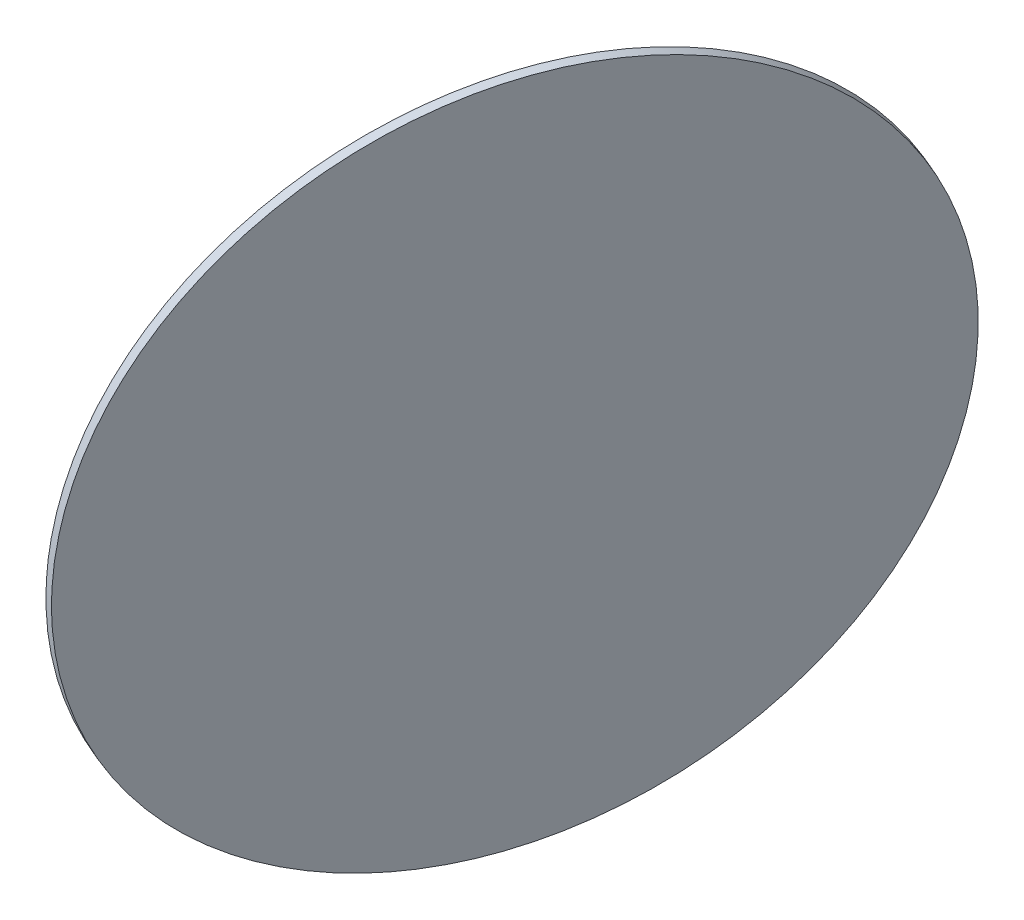
ISO-10303-21;
HEADER;
FILE_DESCRIPTION(('STEP AP214'),'2;1');
FILE_NAME('part.step','',(''),(''),'','','');
FILE_SCHEMA(('AUTOMOTIVE_DESIGN { 1 0 10303 214 1 1 1 1 }'));
ENDSEC;
DATA;
#1=APPLICATION_CONTEXT('core data for automotive mechanical design processes');
#2=APPLICATION_PROTOCOL_DEFINITION('international standard','automotive_design',2000,#1);
#3=PRODUCT_CONTEXT('',#1,'mechanical');
#4=PRODUCT('Part','Part','',(#3));
#5=PRODUCT_RELATED_PRODUCT_CATEGORY('part','',(#4));
#6=PRODUCT_DEFINITION_FORMATION('','',#4);
#7=PRODUCT_DEFINITION_CONTEXT('part definition',#1,'design');
#8=PRODUCT_DEFINITION('design','',#6,#7);
#9=PRODUCT_DEFINITION_SHAPE('','',#8);
#10=(LENGTH_UNIT() NAMED_UNIT(*) SI_UNIT(.MILLI.,.METRE.));
#11=(NAMED_UNIT(*) PLANE_ANGLE_UNIT() SI_UNIT($,.RADIAN.));
#12=(NAMED_UNIT(*) SI_UNIT($,.STERADIAN.) SOLID_ANGLE_UNIT());
#13=UNCERTAINTY_MEASURE_WITH_UNIT(LENGTH_MEASURE(1.E-05),#10,'distance_accuracy_value','');
#14=(GEOMETRIC_REPRESENTATION_CONTEXT(3) GLOBAL_UNCERTAINTY_ASSIGNED_CONTEXT((#13)) GLOBAL_UNIT_ASSIGNED_CONTEXT((#10,
#11,#12)) REPRESENTATION_CONTEXT('',''));
#15=CARTESIAN_POINT('',(0.,0.,0.));
#16=DIRECTION('',(0.,0.,1.));
#17=DIRECTION('',(1.,0.,0.));
#18=AXIS2_PLACEMENT_3D('',#15,#16,#17);
#19=CARTESIAN_POINT('',(-481.922089196081,94.4598188319987,74.0852881046836));
#20=CARTESIAN_POINT('',(-482.673535302618,86.08527129108,73.8122133748399));
#21=CARTESIAN_POINT('',(-483.894115274308,69.3361762092426,72.4891980559884));
#22=CARTESIAN_POINT('',(-484.860416229143,44.4544879989238,68.1931895413502));
#23=CARTESIAN_POINT('',(-484.952842174851,20.0543784602219,61.6270684007838));
#24=CARTESIAN_POINT('',(-484.170502999048,-3.62916601354872,52.8540699702805));
#25=CARTESIAN_POINT('',(-482.520933055668,-26.3680599423632,41.9586830205342));
#26=CARTESIAN_POINT('',(-480.020018605011,-47.9433153473432,29.0458360838957));
#27=CARTESIAN_POINT('',(-476.691844820377,-68.1471507247046,14.2398869352446));
#28=CARTESIAN_POINT('',(-472.568463834677,-86.7849920952234,-2.31657504136209));
#29=CARTESIAN_POINT('',(-467.689586060872,-103.677346858021,-20.4641020664071));
#30=CARTESIAN_POINT('',(-462.102197758989,-118.661532402431,-40.0279235341917));
#31=CARTESIAN_POINT('',(-455.860108532754,-131.593242830473,-60.8196291493088));
#32=CARTESIAN_POINT('',(-449.023433113688,-142.347938701531,-82.6389834207819));
#33=CARTESIAN_POINT('',(-441.658012423382,-150.822046415253,-105.275854039305));
#34=CARTESIAN_POINT('',(-433.834779489435,-156.933955681937,-128.512235566249));
#35=CARTESIAN_POINT('',(-425.629076321613,-160.624805474236,-152.124348945211));
#36=CARTESIAN_POINT('',(-417.119928327116,-161.859050891026,-175.884796616658));
#37=CARTESIAN_POINT('',(-408.389283252705,-160.624805474236,-199.564752480731));
#38=CARTESIAN_POINT('',(-399.521221983102,-156.933955681937,-222.93616561768));
#39=CARTESIAN_POINT('',(-390.60114879611,-150.822046415253,-245.773956542881));
#40=CARTESIAN_POINT('',(-381.714968872726,-142.347938701531,-267.858184845318));
#41=CARTESIAN_POINT('',(-372.948260983294,-131.593242830473,-288.976167333972));
#42=CARTESIAN_POINT('',(-364.385453317158,-118.661532402431,-308.924526293213));
#43=CARTESIAN_POINT('',(-356.10901039305,-103.677346858021,-327.511148121381));
#44=CARTESIAN_POINT('',(-348.198638880693,-86.7849920952233,-344.557033489791));
#45=CARTESIAN_POINT('',(-340.730519982,-68.1471507247046,-359.898021204115));
#46=CARTESIAN_POINT('',(-333.776575764455,-47.9433153473433,-373.386369166429));
#47=CARTESIAN_POINT('',(-327.403776512285,-26.3680599423631,-384.892177212372));
#48=CARTESIAN_POINT('',(-321.673495766015,-3.62916601354882,-394.30463812075));
#49=CARTESIAN_POINT('',(-316.640919261721,20.0543784602218,-401.533104747638));
#50=CARTESIAN_POINT('',(-312.354513462227,44.4544879989238,-406.50796300794));
#51=CARTESIAN_POINT('',(-308.855558798569,69.3361762092424,-409.181302297073));
#52=CARTESIAN_POINT('',(-306.177752116881,94.4598188319987,-409.527376896289));
#53=CARTESIAN_POINT('',(-304.346882159345,119.583461454755,-407.542853918012));
#54=CARTESIAN_POINT('',(-303.38058120451,144.465149665074,-403.246845403373));
#55=CARTESIAN_POINT('',(-303.288155258802,168.865259203775,-396.680724262807));
#56=CARTESIAN_POINT('',(-304.070494434605,192.548803677546,-387.907725832303));
#57=CARTESIAN_POINT('',(-305.720064377986,215.28769760636,-377.012338882557));
#58=CARTESIAN_POINT('',(-308.220978828642,236.862953011341,-364.099491945919));
#59=CARTESIAN_POINT('',(-311.549152613276,257.066788388702,-349.293542797268));
#60=CARTESIAN_POINT('',(-315.672533598976,275.704629759221,-332.737080820661));
#61=CARTESIAN_POINT('',(-320.551411372782,292.596984522018,-314.589553795616));
#62=CARTESIAN_POINT('',(-326.138799674664,307.581170066429,-295.025732327831));
#63=CARTESIAN_POINT('',(-332.380888900899,320.51288049447,-274.234026712714));
#64=CARTESIAN_POINT('',(-339.217564319966,331.267576365528,-252.414672441241));
#65=CARTESIAN_POINT('',(-346.582985010271,339.74168407925,-229.777801822718));
#66=CARTESIAN_POINT('',(-354.406217944218,345.853593345934,-206.541420295774));
#67=CARTESIAN_POINT('',(-362.611921112041,349.544443138233,-182.929306916812));
#68=CARTESIAN_POINT('',(-371.121069106537,350.778688555023,-159.168859245365));
#69=CARTESIAN_POINT('',(-379.851714180948,349.544443138233,-135.488903381292));
#70=CARTESIAN_POINT('',(-388.719775450551,345.853593345935,-112.117490244343));
#71=CARTESIAN_POINT('',(-397.639848637543,339.74168407925,-89.2796993191417));
#72=CARTESIAN_POINT('',(-406.526028560927,331.267576365528,-67.1954710167044));
#73=CARTESIAN_POINT('',(-415.292736450359,320.51288049447,-46.0774885280508));
#74=CARTESIAN_POINT('',(-423.855544116495,307.581170066429,-26.12912956881));
#75=CARTESIAN_POINT('',(-432.131987040604,292.596984522018,-7.54250774064129));
#76=CARTESIAN_POINT('',(-440.04235855296,275.704629759221,9.50337762776827));
#77=CARTESIAN_POINT('',(-447.510477451653,257.066788388702,24.8443653420926));
#78=CARTESIAN_POINT('',(-454.464421669198,236.862953011341,38.3327133044055));
#79=CARTESIAN_POINT('',(-460.837220921368,215.28769760636,49.8385213503491));
#80=CARTESIAN_POINT('',(-466.567501667639,192.548803677546,59.2509822587265));
#81=CARTESIAN_POINT('',(-471.600078171932,168.865259203776,66.4794488856154));
#82=CARTESIAN_POINT('',(-475.886483971426,144.465149665074,71.4543071459168));
#83=CARTESIAN_POINT('',(-479.385438635085,119.583461454755,74.1276464350506));
#84=CARTESIAN_POINT('',(-481.170643089543,102.834366372917,74.3583628345273));
#85=CARTESIAN_POINT('',(-481.922089196081,94.4598188319987,74.0852881046836));
#86=B_SPLINE_CURVE_WITH_KNOTS('',3,(#19,#20,#21,#22,#23,#24,#25,#26,#27,#28,#29,#30,#31,#32,#33,
#34,#35,#36,#37,#38,#39,#40,#41,#42,#43,#44,#45,#46,#47,#48,#49,#50,#51,#52,#53,#54,#55,#56,#57,
#58,#59,#60,#61,#62,#63,#64,#65,#66,#67,#68,#69,#70,#71,#72,#73,#74,#75,#76,#77,#78,#79,#80,#81,
#82,#83,#84,#85),.UNSPECIFIED.,.T.,.F.,(4,1,1,1,1,1,1,1,1,1,1,1,1,1,1,1,1,1,1,1,1,1,1,1,1,1,1,1,
1,1,1,1,1,1,1,1,1,1,1,1,1,1,1,1,1,1,1,1,1,1,1,1,1,1,1,1,1,1,1,1,1,1,1,1,4),(0.,0.015625,0.03125,
0.046875,0.0625,0.078125,0.09375,0.109375,0.125,0.140625,0.15625,0.171875,0.1875,0.203125,
0.21875,0.234375,0.25,0.265625,0.28125,0.296875,0.3125,0.328125,0.34375,0.359375,0.375,0.390625,
0.40625,0.421875,0.4375,0.453125,0.46875,0.484375,0.5,0.515625,0.53125,0.546875,0.5625,0.578125,
0.59375,0.609375,0.625,0.640625,0.65625,0.671875,0.6875,0.703125,0.71875,0.734375,0.75,0.765625,
0.78125,0.796875,0.8125,0.828125,0.84375,0.859375,0.875,0.890625,0.90625,0.921875,0.9375,
0.953125,0.96875,0.984375,1.),.UNSPECIFIED.);
#87=DIRECTION('',(-0.935610835790205,0.0950387497409739,-0.339999999999453));
#88=VECTOR('',#87,1.);
#89=SURFACE_OF_LINEAR_EXTRUSION('',#86,#88);
#90=CARTESIAN_POINT('',(-481.92208919608,94.4598188319987,74.0852881046836));
#91=CARTESIAN_POINT('',(-481.546366142812,98.6470926024581,74.2218254696055));
#92=CARTESIAN_POINT('',(-481.13535405937,102.834366372917,74.2612546021318));
#93=CARTESIAN_POINT('',(-480.243826363065,111.198832479985,74.146035272709));
#94=CARTESIAN_POINT('',(-479.763310750202,115.376024816592,73.9913868107599));
#95=CARTESIAN_POINT('',(-478.733850525977,123.710246622105,73.4881511627017));
#96=CARTESIAN_POINT('',(-478.184905914616,127.86727609101,73.1395639765927));
#97=CARTESIAN_POINT('',(-477.019991728652,136.151187816983,72.2495236184961));
#98=CARTESIAN_POINT('',(-476.40402215405,140.278070074052,71.7080704465085));
#99=CARTESIAN_POINT('',(-475.106462076857,148.491703032223,70.433370854936));
#100=CARTESIAN_POINT('',(-474.424871574268,152.578453733324,69.7001244353511));
#101=CARTESIAN_POINT('',(-472.997789659063,160.702032479836,68.0438346237748));
#102=CARTESIAN_POINT('',(-472.252298246448,164.738860525248,67.1207912317834));
#103=CARTESIAN_POINT('',(-470.69913452915,172.75280286066,65.086903750585));
#104=CARTESIAN_POINT('',(-469.891462224467,176.72991715066,63.976059661378));
#105=CARTESIAN_POINT('',(-468.215956158987,184.614928413583,61.5694713726275));
#106=CARTESIAN_POINT('',(-467.348122398189,188.522825386505,60.273727173084));
#107=CARTESIAN_POINT('',(-465.554312856429,196.259898453602,57.5002392505396));
#108=CARTESIAN_POINT('',(-464.628337075466,200.089074547778,56.0224955275388));
#109=CARTESIAN_POINT('',(-462.720542899046,207.659581358262,52.8887855224097));
#110=CARTESIAN_POINT('',(-461.738724503588,211.400912074572,51.2328192402816));
#111=CARTESIAN_POINT('',(-459.721544503848,218.786603630204,47.7464410812281));
#112=CARTESIAN_POINT('',(-458.686182899566,222.430964469527,45.9160292043028));
#113=CARTESIAN_POINT('',(-456.564473713031,229.61405870853,42.0853768232048));
#114=CARTESIAN_POINT('',(-455.478126130779,233.152792108209,40.0851363190321));
#115=CARTESIAN_POINT('',(-453.25700221916,240.115973905266,35.9194436509894));
#116=CARTESIAN_POINT('',(-452.122225889793,243.540422302644,33.7539914871193));
#117=CARTESIAN_POINT('',(-449.807034912454,250.266926845963,29.2632880065298));
#118=CARTESIAN_POINT('',(-448.626620264482,253.568982991905,26.9380366898105));
#119=CARTESIAN_POINT('',(-446.222943078442,260.042595783218,22.133147410371));
#120=CARTESIAN_POINT('',(-444.999680540374,263.21415242859,19.6535094476508));
#121=CARTESIAN_POINT('',(-442.513304326955,269.419287360393,14.5460027969563));
#122=CARTESIAN_POINT('',(-441.250190651604,272.452865646824,11.918134108982));
#123=CARTESIAN_POINT('',(-438.687108916429,278.374565002377,6.52032192852638));
#124=CARTESIAN_POINT('',(-437.387140856605,281.262686071498,3.75037843604502));
#125=CARTESIAN_POINT('',(-434.753524569233,286.886692550319,-1.92474330366122));
#126=CARTESIAN_POINT('',(-433.419876341684,289.62257796002,-4.82992155088611));
#127=CARTESIAN_POINT('',(-430.722073935606,294.935334677888,-10.7686727503158));
#128=CARTESIAN_POINT('',(-429.357919757078,297.512205986056,-13.8022457025206));
#129=CARTESIAN_POINT('',(-426.60242656028,302.50092175511,-19.9903280065482));
#130=CARTESIAN_POINT('',(-425.211087542011,304.912766215996,-23.144837358371));
#131=CARTESIAN_POINT('',(-422.40454577697,309.565415544738,-29.5673341562726));
#132=CARTESIAN_POINT('',(-420.989343030199,311.806220412594,-32.8353216023513));
#133=CARTESIAN_POINT('',(-418.138509829767,316.111601411915,-39.4767698553625));
#134=CARTESIAN_POINT('',(-416.702879376107,318.176177543381,-42.8502306622948));
#135=CARTESIAN_POINT('',(-413.814626783513,322.123911926564,-49.6946209036106));
#136=CARTESIAN_POINT('',(-412.362004644578,324.007070178281,-53.165550337994));
#137=CARTESIAN_POINT('',(-409.443286522656,327.587653235286,-60.1964037627274));
#138=CARTESIAN_POINT('',(-407.97719053967,329.285078040574,-63.7563277530773));
#139=CARTESIAN_POINT('',(-405.035042570867,332.489878638037,-70.9566962182591));
#140=CARTESIAN_POINT('',(-403.558990585051,333.997254430213,-74.597140693091));
#141=CARTESIAN_POINT('',(-400.600496392688,336.818556572716,-81.949688327611));
#142=CARTESIAN_POINT('',(-399.11805418614,338.132482923043,-85.661791487299));
#143=CARTESIAN_POINT('',(-396.150345334411,340.563485753111,-93.1487946919054));
#144=CARTESIAN_POINT('',(-394.665078689229,341.680562232852,-96.9236947368237));
#145=CARTESIAN_POINT('',(-391.695300342773,343.71541277894,-104.527127528098));
#146=CARTESIAN_POINT('',(-390.210788641499,344.633186845288,-108.355660274455));
#147=CARTESIAN_POINT('',(-387.2460995654,346.266980021786,-116.057194284813));
#148=CARTESIAN_POINT('',(-385.765922190575,346.982999131935,-119.930195548815));
#149=CARTESIAN_POINT('',(-382.813460278949,348.211801358487,-127.711288282605));
#150=CARTESIAN_POINT('',(-381.341175742148,348.724584474891,-131.619379752394));
#151=CARTESIAN_POINT('',(-378.408058018146,349.545433676406,-139.461274585897));
#152=CARTESIAN_POINT('',(-376.947224830944,349.853499761517,-143.395077949613));
#153=CARTESIAN_POINT('',(-374.040513176337,350.264419631361,-151.278894449314));
#154=CARTESIAN_POINT('',(-372.594634708932,350.367273416093,-155.2289075853));
#155=CARTESIAN_POINT('',(-369.721335864114,350.367273416093,-163.135641507887));
#156=CARTESIAN_POINT('',(-368.293915486702,350.264419631361,-167.092362294488));
#157=CARTESIAN_POINT('',(-365.460947311318,349.853499761517,-175.002977097476));
#158=CARTESIAN_POINT('',(-364.055399513346,349.545433676406,-178.956871113864));
#159=CARTESIAN_POINT('',(-361.269590986293,348.724584474891,-186.852297955599));
#160=CARTESIAN_POINT('',(-359.889330257211,348.211801358488,-190.793830780946));
#161=CARTESIAN_POINT('',(-357.157388593237,346.982999131935,-198.655060342286));
#162=CARTESIAN_POINT('',(-355.805707658345,346.266980021786,-202.574757078279));
#163=CARTESIAN_POINT('',(-353.13421830805,344.633186845288,-210.382839562596));
#164=CARTESIAN_POINT('',(-351.814409892647,343.71541277894,-214.271225310921));
#165=CARTESIAN_POINT('',(-349.209804831738,341.680562232852,-222.007361692552));
#166=CARTESIAN_POINT('',(-347.925008186232,340.563485753111,-225.855112325859));
#167=CARTESIAN_POINT('',(-345.393565915523,338.132482923043,-233.500654350103));
#168=CARTESIAN_POINT('',(-344.146920290321,336.818556572716,-237.298445741041));
#169=CARTESIAN_POINT('',(-341.694735603036,333.997254430213,-244.834985720606));
#170=CARTESIAN_POINT('',(-340.489196540953,332.489878638037,-248.573734309233));
#171=CARTESIAN_POINT('',(-338.122180522724,329.285078040574,-255.983105124232));
#172=CARTESIAN_POINT('',(-336.960703566578,327.587653235287,-259.653727350605));
#173=CARTESIAN_POINT('',(-334.684555131956,324.007070178282,-266.918089928208));
#174=CARTESIAN_POINT('',(-333.569883653479,322.123911926564,-270.511830279439));
#175=CARTESIAN_POINT('',(-331.390089545929,318.176177543381,-277.61367359387));
#176=CARTESIAN_POINT('',(-330.324966916855,316.111601411915,-281.121776557071));
#177=CARTESIAN_POINT('',(-328.24677528859,311.806220412594,-288.044001949986));
#178=CARTESIAN_POINT('',(-327.233706289399,309.565415544738,-291.4581243797));
#179=CARTESIAN_POINT('',(-325.262126701379,304.912766215996,-298.184045560184));
#180=CARTESIAN_POINT('',(-324.303616112551,302.50092175511,-301.495844310953));
#181=CARTESIAN_POINT('',(-322.443395412079,297.512205986056,-308.009267704573));
#182=CARTESIAN_POINT('',(-321.541685300435,294.935334677888,-311.210892347423));
#183=CARTESIAN_POINT('',(-319.797307621154,289.62257796002,-317.496117096228));
#184=CARTESIAN_POINT('',(-318.954640053516,286.88669255032,-320.579717202183));
#185=CARTESIAN_POINT('',(-317.330305223082,281.262686071498,-326.621610768627));
#186=CARTESIAN_POINT('',(-316.548637960286,278.374565002377,-329.579904229116));
#187=CARTESIAN_POINT('',(-315.048261500368,272.452865646824,-335.363902396058));
#188=CARTESIAN_POINT('',(-314.329552303247,269.419287360393,-338.189607102511));
#189=CARTESIAN_POINT('',(-312.95674657522,263.21415242859,-343.7017841039));
#190=CARTESIAN_POINT('',(-312.302650044315,260.042595783218,-346.388256398836));
#191=CARTESIAN_POINT('',(-311.060724249259,253.568982991905,-351.615324919713));
#192=CARTESIAN_POINT('',(-310.472894985109,250.266926845963,-354.155921145653));
#193=CARTESIAN_POINT('',(-309.364839229102,243.540422302644,-359.085296304201));
#194=CARTESIAN_POINT('',(-308.844612737246,240.115973905266,-361.474075236809));
#195=CARTESIAN_POINT('',(-307.873098031364,233.152792108209,-366.093874584357));
#196=CARTESIAN_POINT('',(-307.421809817339,229.61405870853,-368.324894999297));
#197=CARTESIAN_POINT('',(-306.589175216008,222.430964469528,-372.623995737557));
#198=CARTESIAN_POINT('',(-306.207828828701,218.786603630205,-374.692076060876));
#199=CARTESIAN_POINT('',(-305.516081429695,211.400912074572,-378.66011504194));
#200=CARTESIAN_POINT('',(-305.205680417995,207.659581358263,-380.560073699685));
#201=CARTESIAN_POINT('',(-304.656485697714,200.089074547778,-384.187497327419));
#202=CARTESIAN_POINT('',(-304.417691989133,196.259898453602,-385.914962297409));
#203=CARTESIAN_POINT('',(-304.012373802603,188.522825386505,-389.19302652745));
#204=CARTESIAN_POINT('',(-303.845849324653,184.614928413583,-390.743625787503));
#205=CARTESIAN_POINT('',(-303.585383530799,176.72991715066,-393.664438232225));
#206=CARTESIAN_POINT('',(-303.491442214895,172.75280286066,-395.034651416895));
#207=CARTESIAN_POINT('',(-303.376456676546,164.738860525248,-397.591171345406));
#208=CARTESIAN_POINT('',(-303.355412454101,160.702032479836,-398.777478089248));
#209=CARTESIAN_POINT('',(-303.386184014654,152.578453733324,-400.963550330437));
#210=CARTESIAN_POINT('',(-303.437999797652,148.491703032223,-401.963315827785));
#211=CARTESIAN_POINT('',(-303.614454281076,140.278070074053,-403.773670770319));
#212=CARTESIAN_POINT('',(-303.739092981502,136.151187816984,-404.584260215505));
#213=CARTESIAN_POINT('',(-304.060805549512,127.86727609101,-406.01453918245));
#214=CARTESIAN_POINT('',(-304.257879417098,123.710246622105,-406.634228704208));
#215=CARTESIAN_POINT('',(-304.724074569159,115.376024816593,-407.680983953027));
#216=CARTESIAN_POINT('',(-304.993195853636,111.198832479985,-408.108049680089));
#217=CARTESIAN_POINT('',(-305.602751161208,102.834366372918,-408.768761004467));
#218=CARTESIAN_POINT('',(-305.943185184304,98.6470926024583,-409.002406601785));
#219=CARTESIAN_POINT('',(-306.694631290841,90.2725450615396,-409.275481331628));
#220=CARTESIAN_POINT('',(-307.105643374283,86.0852712910803,-409.314910464155));
#221=CARTESIAN_POINT('',(-307.997171070588,77.7208051840131,-409.199691134732));
#222=CARTESIAN_POINT('',(-308.477686683451,73.5436128474053,-409.045042672783));
#223=CARTESIAN_POINT('',(-309.507146907676,65.2093910418928,-408.541807024725));
#224=CARTESIAN_POINT('',(-310.056091519037,61.0523615729881,-408.193219838616));
#225=CARTESIAN_POINT('',(-311.221005705,52.7684498470144,-407.303179480519));
#226=CARTESIAN_POINT('',(-311.836975279603,48.6415675899453,-406.761726308531));
#227=CARTESIAN_POINT('',(-313.134535356795,40.4279346317752,-405.487026716959));
#228=CARTESIAN_POINT('',(-313.816125859385,36.3411839306741,-404.753780297374));
#229=CARTESIAN_POINT('',(-315.24320777459,28.2176051841616,-403.097490485798));
#230=CARTESIAN_POINT('',(-315.988699187205,24.1807771387501,-402.174447093806));
#231=CARTESIAN_POINT('',(-317.541862904503,16.1668348033379,-400.140559612608));
#232=CARTESIAN_POINT('',(-318.349535209185,12.1897205133374,-399.029715523401));
#233=CARTESIAN_POINT('',(-320.025041274666,4.30470925041485,-396.62312723465));
#234=CARTESIAN_POINT('',(-320.892875035464,0.396812277492919,-395.327383035107));
#235=CARTESIAN_POINT('',(-322.686684577224,-7.34026078960457,-392.553895112563));
#236=CARTESIAN_POINT('',(-323.612660358187,-11.1694368837801,-391.076151389562));
#237=CARTESIAN_POINT('',(-325.520454534607,-18.739943694265,-387.942441384433));
#238=CARTESIAN_POINT('',(-326.502272930064,-22.4812744105743,-386.286475102305));
#239=CARTESIAN_POINT('',(-328.519452929805,-29.8669659662067,-382.800096943251));
#240=CARTESIAN_POINT('',(-329.554814534087,-33.5113268055299,-380.969685066326));
#241=CARTESIAN_POINT('',(-331.676523720622,-40.6944210445322,-377.139032685228));
#242=CARTESIAN_POINT('',(-332.762871302874,-44.2331544442115,-375.138792181055));
#243=CARTESIAN_POINT('',(-334.983995214493,-51.1963362412684,-370.973099513012));
#244=CARTESIAN_POINT('',(-336.11877154386,-54.6207846386461,-368.807647349142));
#245=CARTESIAN_POINT('',(-338.433962521199,-61.3472891819656,-364.316943868553));
#246=CARTESIAN_POINT('',(-339.614377169171,-64.6493453279074,-361.991692551833));
#247=CARTESIAN_POINT('',(-342.018054355211,-71.1229581192207,-357.186803272394));
#248=CARTESIAN_POINT('',(-343.241316893278,-74.2945147645923,-354.707165309674));
#249=CARTESIAN_POINT('',(-345.727693106698,-80.4996496963953,-349.599658658979));
#250=CARTESIAN_POINT('',(-346.990806782049,-83.5332279828267,-346.971789971005));
#251=CARTESIAN_POINT('',(-349.553888517224,-89.4549273383794,-341.573977790549));
#252=CARTESIAN_POINT('',(-350.853856577047,-92.3430484075007,-338.804034298068));
#253=CARTESIAN_POINT('',(-353.48747286442,-97.9670548863222,-333.128912558361));
#254=CARTESIAN_POINT('',(-354.821121091969,-100.702940296022,-330.223734311137));
#255=CARTESIAN_POINT('',(-357.518923498047,-106.01569701389,-324.284983111707));
#256=CARTESIAN_POINT('',(-358.883077676575,-108.592568322058,-321.251410159502));
#257=CARTESIAN_POINT('',(-361.638570873373,-113.581284091112,-315.063327855475));
#258=CARTESIAN_POINT('',(-363.029909891642,-115.993128551999,-311.908818503652));
#259=CARTESIAN_POINT('',(-365.836451656682,-120.645777880741,-305.48632170575));
#260=CARTESIAN_POINT('',(-367.251654403454,-122.886582748596,-302.218334259672));
#261=CARTESIAN_POINT('',(-370.102487603886,-127.191963747918,-295.57688600666));
#262=CARTESIAN_POINT('',(-371.538118057546,-129.256539879384,-292.203425199728));
#263=CARTESIAN_POINT('',(-374.42637065014,-133.204274262567,-285.359034958412));
#264=CARTESIAN_POINT('',(-375.878992789075,-135.087432514284,-281.888105524029));
#265=CARTESIAN_POINT('',(-378.797710910997,-138.668015571289,-274.857252099295));
#266=CARTESIAN_POINT('',(-380.263806893983,-140.365440376576,-271.297328108945));
#267=CARTESIAN_POINT('',(-383.205954862786,-143.57024097404,-264.096959643764));
#268=CARTESIAN_POINT('',(-384.682006848602,-145.077616766216,-260.456515168932));
#269=CARTESIAN_POINT('',(-387.640501040965,-147.898918908719,-253.103967534412));
#270=CARTESIAN_POINT('',(-389.122943247513,-149.212845259046,-249.391864374724));
#271=CARTESIAN_POINT('',(-392.090652099243,-151.643848089114,-241.904861170117));
#272=CARTESIAN_POINT('',(-393.575918744424,-152.760924568854,-238.129961125199));
#273=CARTESIAN_POINT('',(-396.54569709088,-154.795775114943,-230.526528333924));
#274=CARTESIAN_POINT('',(-398.030208792154,-155.713549181291,-226.697995587568));
#275=CARTESIAN_POINT('',(-400.994897868253,-157.347342357788,-218.99646157721));
#276=CARTESIAN_POINT('',(-402.475075243078,-158.063361467937,-215.123460313208));
#277=CARTESIAN_POINT('',(-405.427537154704,-159.29216369449,-207.342367579417));
#278=CARTESIAN_POINT('',(-406.899821691505,-159.804946810894,-203.434276109629));
#279=CARTESIAN_POINT('',(-409.832939415507,-160.625796012409,-195.592381276125));
#280=CARTESIAN_POINT('',(-411.293772602709,-160.93386209752,-191.65857791241));
#281=CARTESIAN_POINT('',(-414.200484257316,-161.344781967364,-183.774761412708));
#282=CARTESIAN_POINT('',(-415.646362724721,-161.447635752096,-179.824748276722));
#283=CARTESIAN_POINT('',(-418.519661569539,-161.447635752096,-171.918014354135));
#284=CARTESIAN_POINT('',(-419.947081946952,-161.344781967364,-167.961293567535));
#285=CARTESIAN_POINT('',(-422.780050122335,-160.93386209752,-160.050678764547));
#286=CARTESIAN_POINT('',(-424.185597920307,-160.625796012409,-156.096784748159));
#287=CARTESIAN_POINT('',(-426.97140644736,-159.804946810894,-148.201357906424));
#288=CARTESIAN_POINT('',(-428.351667176442,-159.29216369449,-144.259825081077));
#289=CARTESIAN_POINT('',(-431.083608840416,-158.063361467937,-136.398595519737));
#290=CARTESIAN_POINT('',(-432.435289775308,-157.347342357788,-132.478898783744));
#291=CARTESIAN_POINT('',(-435.106779125603,-155.713549181291,-124.670816299426));
#292=CARTESIAN_POINT('',(-436.426587541006,-154.795775114943,-120.782430551101));
#293=CARTESIAN_POINT('',(-439.031192601915,-152.760924568854,-113.04629416947));
#294=CARTESIAN_POINT('',(-440.315989247421,-151.643848089114,-109.198543536164));
#295=CARTESIAN_POINT('',(-442.84743151813,-149.212845259046,-101.553001511919));
#296=CARTESIAN_POINT('',(-444.094077143332,-147.898918908719,-97.7552101209814));
#297=CARTESIAN_POINT('',(-446.546261830617,-145.077616766216,-90.2186701414166));
#298=CARTESIAN_POINT('',(-447.7518008927,-143.57024097404,-86.4799215527899));
#299=CARTESIAN_POINT('',(-450.118816910929,-140.365440376576,-79.0705507377906));
#300=CARTESIAN_POINT('',(-451.280293867075,-138.668015571289,-75.3999285114179));
#301=CARTESIAN_POINT('',(-453.556442301697,-135.087432514284,-68.1355659338147));
#302=CARTESIAN_POINT('',(-454.671113780174,-133.204274262567,-64.541825582584));
#303=CARTESIAN_POINT('',(-456.850907887724,-129.256539879384,-57.4399822681523));
#304=CARTESIAN_POINT('',(-457.916030516798,-127.191963747918,-53.9318793049513));
#305=CARTESIAN_POINT('',(-459.994222145063,-122.886582748596,-47.0096539120363));
#306=CARTESIAN_POINT('',(-461.007291144254,-120.645777880741,-43.5955314823223));
#307=CARTESIAN_POINT('',(-462.978870732273,-115.993128551999,-36.8696103018387));
#308=CARTESIAN_POINT('',(-463.937381321102,-113.581284091112,-33.5578115510691));
#309=CARTESIAN_POINT('',(-465.797602021574,-108.592568322058,-27.0443881574495));
#310=CARTESIAN_POINT('',(-466.699312133218,-106.01569701389,-23.8427635145995));
#311=CARTESIAN_POINT('',(-468.443689812499,-100.702940296022,-17.5575387657946));
#312=CARTESIAN_POINT('',(-469.286357380137,-97.9670548863223,-14.4739386598396));
#313=CARTESIAN_POINT('',(-470.910692210571,-92.3430484075009,-8.43204509339533));
#314=CARTESIAN_POINT('',(-471.692359473367,-89.4549273383796,-5.47375163290609));
#315=CARTESIAN_POINT('',(-473.192735933285,-83.5332279828268,0.310246534035855));
#316=CARTESIAN_POINT('',(-473.911445130406,-80.4996496963954,3.13595124048857));
#317=CARTESIAN_POINT('',(-475.284250858433,-74.2945147645924,8.64812824187757));
#318=CARTESIAN_POINT('',(-475.938347389338,-71.1229581192209,11.3346005368139));
#319=CARTESIAN_POINT('',(-477.180273184394,-64.6493453279075,16.5616690576902));
#320=CARTESIAN_POINT('',(-477.768102448544,-61.3472891819657,19.1022652836301));
#321=CARTESIAN_POINT('',(-478.876158204551,-54.6207846386462,24.0316404421781));
#322=CARTESIAN_POINT('',(-479.396384696407,-51.1963362412686,26.4204193747861));
#323=CARTESIAN_POINT('',(-480.367899402289,-44.2331544442117,31.0402187223344));
#324=CARTESIAN_POINT('',(-480.819187616314,-40.6944210445324,33.2712391372747));
#325=CARTESIAN_POINT('',(-481.651822217646,-33.5113268055301,37.5703398755342));
#326=CARTESIAN_POINT('',(-482.033168604952,-29.866965966207,39.6384201988535));
#327=CARTESIAN_POINT('',(-482.724916003958,-22.4812744105746,43.6064591799176));
#328=CARTESIAN_POINT('',(-483.035317015658,-18.7399436942653,45.5064178376625));
#329=CARTESIAN_POINT('',(-483.584511735939,-11.1694368837804,49.1338414653967));
#330=CARTESIAN_POINT('',(-483.82330544452,-7.34026078960479,50.8613064353859));
#331=CARTESIAN_POINT('',(-484.22862363105,0.396812277492724,54.1393706654275));
#332=CARTESIAN_POINT('',(-484.395148109,4.30470925041465,55.6899699254799));
#333=CARTESIAN_POINT('',(-484.655613902854,12.1897205133372,58.6107823702021));
#334=CARTESIAN_POINT('',(-484.749555218758,16.1668348033377,59.9809955548719));
#335=CARTESIAN_POINT('',(-484.864540757107,24.1807771387498,62.5375154833835));
#336=CARTESIAN_POINT('',(-484.885584979552,28.2176051841613,63.7238222272253));
#337=CARTESIAN_POINT('',(-484.854813418999,36.3411839306738,65.9098944684144));
#338=CARTESIAN_POINT('',(-484.802997636001,40.4279346317748,66.9096599657618));
#339=CARTESIAN_POINT('',(-484.626543152577,48.641567589945,68.7200149082959));
#340=CARTESIAN_POINT('',(-484.501904452151,52.7684498470141,69.5306043534826));
#341=CARTESIAN_POINT('',(-484.18019188414,61.0523615729879,70.9608833204273));
#342=CARTESIAN_POINT('',(-483.983118016555,65.2093910418925,71.5805728421853));
#343=CARTESIAN_POINT('',(-483.516922864493,73.543612847405,72.6273280910045));
#344=CARTESIAN_POINT('',(-483.247801580017,77.7208051840128,73.0543938180658));
#345=CARTESIAN_POINT('',(-482.638246272445,86.08527129108,73.7151051424444));
#346=CARTESIAN_POINT('',(-482.297812249349,90.2725450615393,73.9487507397618));
#347=CARTESIAN_POINT('',(-481.92208919608,94.4598188319987,74.0852881046836));
#348=B_SPLINE_CURVE_WITH_KNOTS('',3,(#90,#91,#92,#93,#94,#95,#96,#97,#98,#99,#100,#101,#102,
#103,#104,#105,#106,#107,#108,#109,#110,#111,#112,#113,#114,#115,#116,#117,#118,#119,#120,#121,
#122,#123,#124,#125,#126,#127,#128,#129,#130,#131,#132,#133,#134,#135,#136,#137,#138,#139,#140,
#141,#142,#143,#144,#145,#146,#147,#148,#149,#150,#151,#152,#153,#154,#155,#156,#157,#158,#159,
#160,#161,#162,#163,#164,#165,#166,#167,#168,#169,#170,#171,#172,#173,#174,#175,#176,#177,#178,
#179,#180,#181,#182,#183,#184,#185,#186,#187,#188,#189,#190,#191,#192,#193,#194,#195,#196,#197,
#198,#199,#200,#201,#202,#203,#204,#205,#206,#207,#208,#209,#210,#211,#212,#213,#214,#215,#216,
#217,#218,#219,#220,#221,#222,#223,#224,#225,#226,#227,#228,#229,#230,#231,#232,#233,#234,#235,
#236,#237,#238,#239,#240,#241,#242,#243,#244,#245,#246,#247,#248,#249,#250,#251,#252,#253,#254,
#255,#256,#257,#258,#259,#260,#261,#262,#263,#264,#265,#266,#267,#268,#269,#270,#271,#272,#273,
#274,#275,#276,#277,#278,#279,#280,#281,#282,#283,#284,#285,#286,#287,#288,#289,#290,#291,#292,
#293,#294,#295,#296,#297,#298,#299,#300,#301,#302,#303,#304,#305,#306,#307,#308,#309,#310,#311,
#312,#313,#314,#315,#316,#317,#318,#319,#320,#321,#322,#323,#324,#325,#326,#327,#328,#329,#330,
#331,#332,#333,#334,#335,#336,#337,#338,#339,#340,#341,#342,#343,#344,#345,#346,#347),
.UNSPECIFIED.,.F.,.F.,(4,2,2,2,2,2,2,2,2,2,2,2,2,2,2,2,2,2,2,2,2,2,2,2,2,2,2,2,2,2,2,2,2,2,2,2,
2,2,2,2,2,2,2,2,2,2,2,2,2,2,2,2,2,2,2,2,2,2,2,2,2,2,2,2,2,2,2,2,2,2,2,2,2,2,2,2,2,2,2,2,2,2,2,2,
2,2,2,2,2,2,2,2,2,2,2,2,2,2,2,2,2,2,2,2,2,2,2,2,2,2,2,2,2,2,2,2,2,2,2,2,2,2,2,2,2,2,2,2,4),(0.,
12.6176781138511,25.2353562277022,37.8530343415533,50.4707124554043,63.0883905692554,
75.7060686831064,88.3237467969574,100.941424910808,113.559103024659,126.17678113851,
138.794459252362,151.412137366213,164.029815480064,176.647493593915,189.265171707766,
201.882849821617,214.500527935468,227.118206049319,239.73588416317,252.353562277021,
264.971240390872,277.588918504723,290.206596618574,302.824274732425,315.441952846276,
328.059630960127,340.677309073979,353.29498718783,365.912665301681,378.530343415532,
391.148021529383,403.765699643234,416.383377757085,429.001055870936,441.618733984787,
454.236412098638,466.854090212489,479.47176832634,492.089446440191,504.707124554042,
517.324802667893,529.942480781744,542.560158895595,555.177837009446,567.795515123297,
580.413193237148,593.030871350999,605.64854946485,618.266227578702,630.883905692553,
643.501583806404,656.119261920255,668.736940034106,681.354618147957,693.972296261808,
706.589974375659,719.20765248951,731.825330603361,744.443008717212,757.060686831063,
769.678364944914,782.296043058765,794.913721172617,807.531399286468,820.149077400319,
832.76675551417,845.384433628021,858.002111741872,870.619789855723,883.237467969574,
895.855146083425,908.472824197276,921.090502311127,933.708180424978,946.325858538829,
958.94353665268,971.561214766531,984.178892880382,996.796570994234,1009.41424910808,
1022.03192722194,1034.64960533579,1047.26728344964,1059.88496156349,1072.50263967734,
1085.12031779119,1097.73799590504,1110.35567401889,1122.97335213274,1135.5910302466,
1148.20870836045,1160.8263864743,1173.44406458815,1186.061742702,1198.67942081585,
1211.2970989297,1223.91477704355,1236.5324551574,1249.15013327125,1261.76781138511,
1274.38548949896,1287.00316761281,1299.62084572666,1312.23852384051,1324.85620195436,
1337.47388006821,1350.09155818206,1362.70923629591,1375.32691440977,1387.94459252362,
1400.56227063747,1413.17994875132,1425.79762686517,1438.41530497902,1451.03298309287,
1463.65066120672,1476.26833932057,1488.88601743443,1501.50369554828,1514.12137366213,
1526.73905177598,1539.35672988983,1551.97440800368,1564.59208611753,1577.20976423138,
1589.82744234523,1602.44512045909,1615.06279857294),.UNSPECIFIED.);
#349=CARTESIAN_POINT('',(-481.92208919608,94.4598188319987,74.0852881046836));
#350=VERTEX_POINT('',#349);
#351=EDGE_CURVE('E9',#350,#350,#348,.F.);
#352=ORIENTED_EDGE('',*,*,#351,.F.);
#353=EDGE_LOOP('',(#352));
#354=FACE_BOUND('',#353,.T.);
#355=CARTESIAN_POINT('',(-488.144590241952,95.0918965047226,71.8240377272166));
#356=CARTESIAN_POINT('',(-488.896036348489,86.7173489638038,71.5509629973729));
#357=CARTESIAN_POINT('',(-490.116616320179,69.9682538819665,70.2279476785214));
#358=CARTESIAN_POINT('',(-491.082917275014,45.0865656716476,65.9319391638832));
#359=CARTESIAN_POINT('',(-491.175343220722,20.6864561329458,59.3658180233169));
#360=CARTESIAN_POINT('',(-490.393004044919,-2.99708834082487,50.5928195928136));
#361=CARTESIAN_POINT('',(-488.743434101539,-25.7359822696393,39.6974326430673));
#362=CARTESIAN_POINT('',(-486.242519650882,-47.3112376746194,26.7845857064287));
#363=CARTESIAN_POINT('',(-482.914345866248,-67.5150730519807,11.9786365577776));
#364=CARTESIAN_POINT('',(-478.790964880548,-86.1529144224996,-4.57782541882902));
#365=CARTESIAN_POINT('',(-473.912087106743,-103.045269185297,-22.7253524438741));
#366=CARTESIAN_POINT('',(-468.32469880486,-118.029454729707,-42.2891739116587));
#367=CARTESIAN_POINT('',(-462.082609578625,-130.961165157749,-63.0808795267758));
#368=CARTESIAN_POINT('',(-455.245934159559,-141.715861028807,-84.9002337982488));
#369=CARTESIAN_POINT('',(-447.880513469253,-150.189968742529,-107.537104416772));
#370=CARTESIAN_POINT('',(-440.057280535306,-156.301878009214,-130.773485943715));
#371=CARTESIAN_POINT('',(-431.851577367484,-159.992727801512,-154.385599322678));
#372=CARTESIAN_POINT('',(-423.342429372987,-161.226973218302,-178.146046994124));
#373=CARTESIAN_POINT('',(-414.611784298576,-159.992727801512,-201.826002858198));
#374=CARTESIAN_POINT('',(-405.743723028973,-156.301878009213,-225.197415995147));
#375=CARTESIAN_POINT('',(-396.823649841981,-150.189968742529,-248.035206920348));
#376=CARTESIAN_POINT('',(-387.937469918597,-141.715861028807,-270.119435222785));
#377=CARTESIAN_POINT('',(-379.170762029165,-130.961165157749,-291.237417711439));
#378=CARTESIAN_POINT('',(-370.607954363029,-118.029454729707,-311.18577667068));
#379=CARTESIAN_POINT('',(-362.331511438921,-103.045269185297,-329.772398498848));
#380=CARTESIAN_POINT('',(-354.421139926564,-86.1529144224995,-346.818283867258));
#381=CARTESIAN_POINT('',(-346.953021027871,-67.5150730519808,-362.159271581582));
#382=CARTESIAN_POINT('',(-339.999076810326,-47.3112376746195,-375.647619543896));
#383=CARTESIAN_POINT('',(-333.626277558156,-25.7359822696392,-387.153427589839));
#384=CARTESIAN_POINT('',(-327.895996811886,-2.99708834082497,-396.565888498217));
#385=CARTESIAN_POINT('',(-322.863420307592,20.6864561329457,-403.794355125105));
#386=CARTESIAN_POINT('',(-318.577014508098,45.0865656716476,-408.769213385407));
#387=CARTESIAN_POINT('',(-315.07805984444,69.9682538819663,-411.44255267454));
#388=CARTESIAN_POINT('',(-312.400253162752,95.0918965047225,-411.788627273755));
#389=CARTESIAN_POINT('',(-310.569383205216,120.215539127479,-409.804104295478));
#390=CARTESIAN_POINT('',(-309.603082250381,145.097227337798,-405.50809578084));
#391=CARTESIAN_POINT('',(-309.510656304673,169.497336876499,-398.941974640274));
#392=CARTESIAN_POINT('',(-310.292995480476,193.18088135027,-390.16897620977));
#393=CARTESIAN_POINT('',(-311.942565423857,215.919775279084,-379.273589260024));
#394=CARTESIAN_POINT('',(-314.443479874513,237.495030684065,-366.360742323386));
#395=CARTESIAN_POINT('',(-317.771653659147,257.698866061425,-351.554793174735));
#396=CARTESIAN_POINT('',(-321.895034644847,276.336707431945,-334.998331198128));
#397=CARTESIAN_POINT('',(-326.773912418653,293.229062194742,-316.850804173083));
#398=CARTESIAN_POINT('',(-332.361300720535,308.213247739152,-297.286982705298));
#399=CARTESIAN_POINT('',(-338.60338994677,321.144958167194,-276.495277090181));
#400=CARTESIAN_POINT('',(-345.440065365837,331.899654038252,-254.675922818708));
#401=CARTESIAN_POINT('',(-352.805486056142,340.373761751974,-232.039052200185));
#402=CARTESIAN_POINT('',(-360.628718990089,346.485671018658,-208.802670673241));
#403=CARTESIAN_POINT('',(-368.834422157912,350.176520810957,-185.190557294279));
#404=CARTESIAN_POINT('',(-377.343570152408,351.410766227747,-161.430109622832));
#405=CARTESIAN_POINT('',(-386.074215226819,350.176520810957,-137.750153758759));
#406=CARTESIAN_POINT('',(-394.942276496422,346.485671018658,-114.37874062181));
#407=CARTESIAN_POINT('',(-403.862349683414,340.373761751974,-91.5409496966086));
#408=CARTESIAN_POINT('',(-412.748529606798,331.899654038252,-69.4567213941713));
#409=CARTESIAN_POINT('',(-421.51523749623,321.144958167194,-48.3387389055177));
#410=CARTESIAN_POINT('',(-430.078045162367,308.213247739153,-28.3903799462769));
#411=CARTESIAN_POINT('',(-438.354488086475,293.229062194742,-9.80375811810821));
#412=CARTESIAN_POINT('',(-446.264859598831,276.336707431945,7.24212725030134));
#413=CARTESIAN_POINT('',(-453.732978497524,257.698866061426,22.5831149646257));
#414=CARTESIAN_POINT('',(-460.686922715069,237.495030684065,36.0714629269386));
#415=CARTESIAN_POINT('',(-467.059721967239,215.919775279084,47.5772709728822));
#416=CARTESIAN_POINT('',(-472.79000271351,193.18088135027,56.9897318812596));
#417=CARTESIAN_POINT('',(-477.822579217803,169.4973368765,64.2181985081484));
#418=CARTESIAN_POINT('',(-482.108985017297,145.097227337798,69.1930567684499));
#419=CARTESIAN_POINT('',(-485.607939680956,120.215539127479,71.8663960575836));
#420=CARTESIAN_POINT('',(-487.393144135414,103.466444045641,72.0971124570603));
#421=CARTESIAN_POINT('',(-488.144590241952,95.0918965047225,71.8240377272166));
#422=B_SPLINE_CURVE_WITH_KNOTS('',3,(#355,#356,#357,#358,#359,#360,#361,#362,#363,#364,#365,
#366,#367,#368,#369,#370,#371,#372,#373,#374,#375,#376,#377,#378,#379,#380,#381,#382,#383,#384,
#385,#386,#387,#388,#389,#390,#391,#392,#393,#394,#395,#396,#397,#398,#399,#400,#401,#402,#403,
#404,#405,#406,#407,#408,#409,#410,#411,#412,#413,#414,#415,#416,#417,#418,#419,#420,#421),
.UNSPECIFIED.,.T.,.F.,(4,1,1,1,1,1,1,1,1,1,1,1,1,1,1,1,1,1,1,1,1,1,1,1,1,1,1,1,1,1,1,1,1,1,1,1,
1,1,1,1,1,1,1,1,1,1,1,1,1,1,1,1,1,1,1,1,1,1,1,1,1,1,1,1,4),(0.,0.015625,0.03125,0.046875,0.0625,
0.078125,0.09375,0.109375,0.125,0.140625,0.15625,0.171875,0.1875,0.203125,0.21875,0.234375,0.25,
0.265625,0.28125,0.296875,0.3125,0.328125,0.34375,0.359375,0.375,0.390625,0.40625,0.421875,
0.4375,0.453125,0.46875,0.484375,0.5,0.515625,0.53125,0.546875,0.5625,0.578125,0.59375,0.609375,
0.625,0.640625,0.65625,0.671875,0.6875,0.703125,0.71875,0.734375,0.75,0.765625,0.78125,0.796875,
0.8125,0.828125,0.84375,0.859375,0.875,0.890625,0.90625,0.921875,0.9375,0.953125,0.96875,
0.984375,1.),.UNSPECIFIED.);
#423=CARTESIAN_POINT('',(-488.144590241952,95.0918965047226,71.8240377272166));
#424=VERTEX_POINT('',#423);
#425=EDGE_CURVE('E24',#424,#424,#422,.T.);
#426=ORIENTED_EDGE('',*,*,#425,.T.);
#427=EDGE_LOOP('',(#426));
#428=FACE_BOUND('',#427,.T.);
#429=ADVANCED_FACE('F14',(#354,#428),#89,.F.);
#430=CARTESIAN_POINT('',(-368.855670124597,343.179919419396,-167.526827931002));
#431=DIRECTION('',(-0.935610835790205,0.0950387497409739,-0.339999999999453));
#432=DIRECTION('',(-0.101059314368933,-0.99488040234959,0.));
#433=AXIS2_PLACEMENT_3D('',#430,#431,#432);
#434=PLANE('',#433);
#435=ORIENTED_EDGE('',*,*,#351,.T.);
#436=EDGE_LOOP('',(#435));
#437=FACE_BOUND('',#436,.T.);
#438=ADVANCED_FACE('F59',(#437),#434,.F.);
#439=CARTESIAN_POINT('',(-375.078171170468,343.81199709212,-169.788078308469));
#440=DIRECTION('',(-0.935610835790205,0.0950387497409739,-0.339999999999453));
#441=DIRECTION('',(-0.101059314368933,-0.99488040234959,0.));
#442=AXIS2_PLACEMENT_3D('',#439,#440,#441);
#443=PLANE('',#442);
#444=ORIENTED_EDGE('',*,*,#425,.F.);
#445=EDGE_LOOP('',(#444));
#446=FACE_BOUND('',#445,.T.);
#447=ADVANCED_FACE('F67',(#446),#443,.T.);
#448=CLOSED_SHELL('',(#429,#438,#447));
#449=MANIFOLD_SOLID_BREP('B1',#448);
#450=ADVANCED_BREP_SHAPE_REPRESENTATION('',(#18,#449),#14);
#451=SHAPE_DEFINITION_REPRESENTATION(#9,#450);
ENDSEC;
END-ISO-10303-21;
